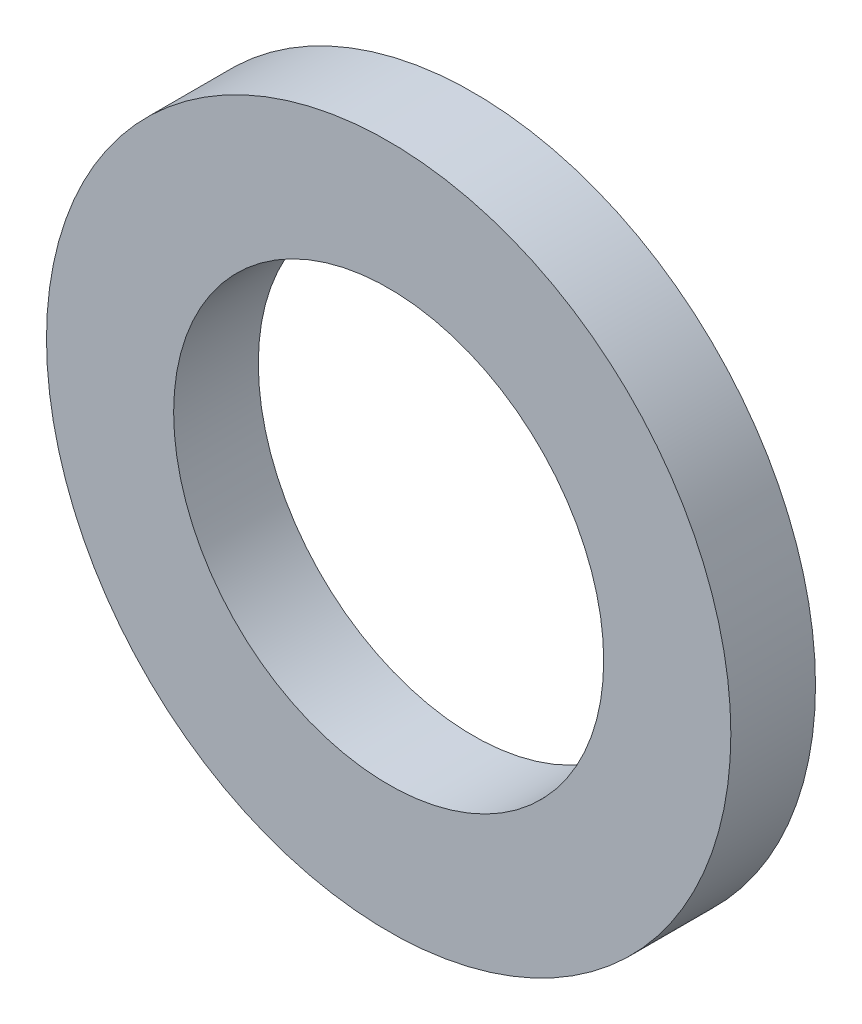
ISO-10303-21;
HEADER;
FILE_DESCRIPTION(('STEP AP214'),'2;1');
FILE_NAME('part.step','',(''),(''),'','','');
FILE_SCHEMA(('AUTOMOTIVE_DESIGN { 1 0 10303 214 1 1 1 1 }'));
ENDSEC;
DATA;
#1=APPLICATION_CONTEXT('core data for automotive mechanical design processes');
#2=APPLICATION_PROTOCOL_DEFINITION('international standard','automotive_design',2000,#1);
#3=PRODUCT_CONTEXT('',#1,'mechanical');
#4=PRODUCT('Part','Part','',(#3));
#5=PRODUCT_RELATED_PRODUCT_CATEGORY('part','',(#4));
#6=PRODUCT_DEFINITION_FORMATION('','',#4);
#7=PRODUCT_DEFINITION_CONTEXT('part definition',#1,'design');
#8=PRODUCT_DEFINITION('design','',#6,#7);
#9=PRODUCT_DEFINITION_SHAPE('','',#8);
#10=(LENGTH_UNIT() NAMED_UNIT(*) SI_UNIT(.MILLI.,.METRE.));
#11=(NAMED_UNIT(*) PLANE_ANGLE_UNIT() SI_UNIT($,.RADIAN.));
#12=(NAMED_UNIT(*) SI_UNIT($,.STERADIAN.) SOLID_ANGLE_UNIT());
#13=UNCERTAINTY_MEASURE_WITH_UNIT(LENGTH_MEASURE(1.E-05),#10,'distance_accuracy_value','');
#14=(GEOMETRIC_REPRESENTATION_CONTEXT(3) GLOBAL_UNCERTAINTY_ASSIGNED_CONTEXT((#13)) GLOBAL_UNIT_ASSIGNED_CONTEXT((#10,
#11,#12)) REPRESENTATION_CONTEXT('',''));
#15=CARTESIAN_POINT('',(0.,0.,0.));
#16=DIRECTION('',(0.,0.,1.));
#17=DIRECTION('',(1.,0.,0.));
#18=AXIS2_PLACEMENT_3D('',#15,#16,#17);
#19=CARTESIAN_POINT('',(0.,0.,1.5748));
#20=DIRECTION('',(0.,0.,1.));
#21=DIRECTION('',(1.,0.,0.));
#22=AXIS2_PLACEMENT_3D('',#19,#20,#21);
#23=PLANE('',#22);
#24=CARTESIAN_POINT('',(0.,0.,1.5748));
#25=DIRECTION('',(0.,0.,1.));
#26=DIRECTION('',(1.,0.,0.));
#27=AXIS2_PLACEMENT_3D('',#24,#25,#26);
#28=CIRCLE('',#27,6.36499997000001);
#29=CARTESIAN_POINT('',(6.36499997000001,0.,1.5748));
#30=VERTEX_POINT('',#29);
#31=EDGE_CURVE('E10',#30,#30,#28,.T.);
#32=ORIENTED_EDGE('',*,*,#31,.T.);
#33=EDGE_LOOP('',(#32));
#34=FACE_BOUND('',#33,.T.);
#35=CARTESIAN_POINT('',(0.,0.,1.5748));
#36=DIRECTION('',(0.,0.,1.));
#37=DIRECTION('',(1.,0.,0.));
#38=AXIS2_PLACEMENT_3D('',#35,#36,#37);
#39=CIRCLE('',#38,4.);
#40=CARTESIAN_POINT('',(4.,0.,1.5748));
#41=VERTEX_POINT('',#40);
#42=EDGE_CURVE('E42',#41,#41,#39,.T.);
#43=ORIENTED_EDGE('',*,*,#42,.F.);
#44=EDGE_LOOP('',(#43));
#45=FACE_BOUND('',#44,.T.);
#46=ADVANCED_FACE('F31',(#34,#45),#23,.T.);
#47=CARTESIAN_POINT('',(0.,0.,0.));
#48=DIRECTION('',(0.,0.,1.));
#49=DIRECTION('',(1.,0.,0.));
#50=AXIS2_PLACEMENT_3D('',#47,#48,#49);
#51=PLANE('',#50);
#52=CARTESIAN_POINT('',(0.,0.,0.));
#53=DIRECTION('',(0.,0.,1.));
#54=DIRECTION('',(1.,0.,0.));
#55=AXIS2_PLACEMENT_3D('',#52,#53,#54);
#56=CIRCLE('',#55,6.36499997000001);
#57=CARTESIAN_POINT('',(6.36499997000001,0.,0.));
#58=VERTEX_POINT('',#57);
#59=EDGE_CURVE('E35',#58,#58,#56,.T.);
#60=ORIENTED_EDGE('',*,*,#59,.F.);
#61=EDGE_LOOP('',(#60));
#62=FACE_BOUND('',#61,.T.);
#63=CARTESIAN_POINT('',(0.,0.,0.));
#64=DIRECTION('',(0.,0.,1.));
#65=DIRECTION('',(1.,0.,0.));
#66=AXIS2_PLACEMENT_3D('',#63,#64,#65);
#67=CIRCLE('',#66,4.);
#68=CARTESIAN_POINT('',(4.,0.,0.));
#69=VERTEX_POINT('',#68);
#70=EDGE_CURVE('E44',#69,#69,#67,.T.);
#71=ORIENTED_EDGE('',*,*,#70,.T.);
#72=EDGE_LOOP('',(#71));
#73=FACE_BOUND('',#72,.T.);
#74=ADVANCED_FACE('F54',(#62,#73),#51,.F.);
#75=CARTESIAN_POINT('',(0.,0.,1.5748));
#76=DIRECTION('',(0.,0.,-1.));
#77=DIRECTION('',(-1.,0.,0.));
#78=AXIS2_PLACEMENT_3D('',#75,#76,#77);
#79=CYLINDRICAL_SURFACE('',#78,6.36499997000001);
#80=ORIENTED_EDGE('',*,*,#31,.F.);
#81=EDGE_LOOP('',(#80));
#82=FACE_BOUND('',#81,.T.);
#83=ORIENTED_EDGE('',*,*,#59,.T.);
#84=EDGE_LOOP('',(#83));
#85=FACE_BOUND('',#84,.T.);
#86=ADVANCED_FACE('F33',(#82,#85),#79,.T.);
#87=CARTESIAN_POINT('',(0.,0.,1.5748));
#88=DIRECTION('',(0.,0.,-1.));
#89=DIRECTION('',(-1.,0.,0.));
#90=AXIS2_PLACEMENT_3D('',#87,#88,#89);
#91=CYLINDRICAL_SURFACE('',#90,4.);
#92=ORIENTED_EDGE('',*,*,#42,.T.);
#93=EDGE_LOOP('',(#92));
#94=FACE_BOUND('',#93,.T.);
#95=ORIENTED_EDGE('',*,*,#70,.F.);
#96=EDGE_LOOP('',(#95));
#97=FACE_BOUND('',#96,.T.);
#98=ADVANCED_FACE('F50',(#94,#97),#91,.F.);
#99=CLOSED_SHELL('',(#46,#74,#86,#98));
#100=MANIFOLD_SOLID_BREP('B2',#99);
#101=ADVANCED_BREP_SHAPE_REPRESENTATION('',(#18,#100),#14);
#102=SHAPE_DEFINITION_REPRESENTATION(#9,#101);
ENDSEC;
END-ISO-10303-21;
